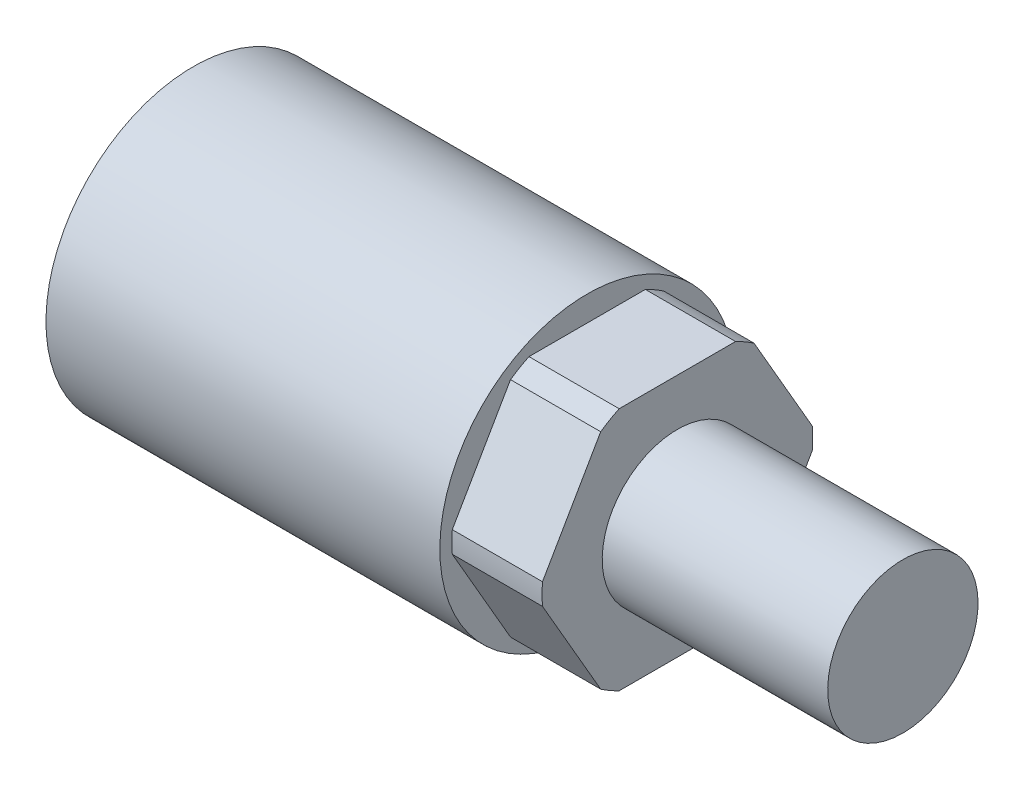
ISO-10303-21;
HEADER;
FILE_DESCRIPTION(('STEP AP214'),'2;1');
FILE_NAME('part.step','',(''),(''),'','','');
FILE_SCHEMA(('AUTOMOTIVE_DESIGN { 1 0 10303 214 1 1 1 1 }'));
ENDSEC;
DATA;
#1=APPLICATION_CONTEXT('core data for automotive mechanical design processes');
#2=APPLICATION_PROTOCOL_DEFINITION('international standard','automotive_design',2000,#1);
#3=PRODUCT_CONTEXT('',#1,'mechanical');
#4=PRODUCT('Part','Part','',(#3));
#5=PRODUCT_RELATED_PRODUCT_CATEGORY('part','',(#4));
#6=PRODUCT_DEFINITION_FORMATION('','',#4);
#7=PRODUCT_DEFINITION_CONTEXT('part definition',#1,'design');
#8=PRODUCT_DEFINITION('design','',#6,#7);
#9=PRODUCT_DEFINITION_SHAPE('','',#8);
#10=(LENGTH_UNIT() NAMED_UNIT(*) SI_UNIT(.MILLI.,.METRE.));
#11=(NAMED_UNIT(*) PLANE_ANGLE_UNIT() SI_UNIT($,.RADIAN.));
#12=(NAMED_UNIT(*) SI_UNIT($,.STERADIAN.) SOLID_ANGLE_UNIT());
#13=UNCERTAINTY_MEASURE_WITH_UNIT(LENGTH_MEASURE(1.E-05),#10,'distance_accuracy_value','');
#14=(GEOMETRIC_REPRESENTATION_CONTEXT(3) GLOBAL_UNCERTAINTY_ASSIGNED_CONTEXT((#13)) GLOBAL_UNIT_ASSIGNED_CONTEXT((#10,
#11,#12)) REPRESENTATION_CONTEXT('',''));
#15=CARTESIAN_POINT('',(0.,0.,0.));
#16=DIRECTION('',(0.,0.,1.));
#17=DIRECTION('',(1.,0.,0.));
#18=AXIS2_PLACEMENT_3D('',#15,#16,#17);
#19=CARTESIAN_POINT('',(0.,6.35,0.));
#20=DIRECTION('',(-1.,0.,0.));
#21=DIRECTION('',(0.,-1.,0.));
#22=AXIS2_PLACEMENT_3D('',#19,#20,#21);
#23=PLANE('',#22);
#24=CARTESIAN_POINT('',(0.,0.,0.));
#25=DIRECTION('',(-1.,0.,0.));
#26=DIRECTION('',(0.,-1.,0.));
#27=AXIS2_PLACEMENT_3D('',#24,#25,#26);
#28=CIRCLE('',#27,6.35);
#29=CARTESIAN_POINT('',(0.,-6.35,0.));
#30=VERTEX_POINT('',#29);
#31=EDGE_CURVE('E163',#30,#30,#28,.T.);
#32=ORIENTED_EDGE('',*,*,#31,.T.);
#33=EDGE_LOOP('',(#32));
#34=FACE_BOUND('',#33,.T.);
#35=DIRECTION('',(0.,0.866025403784438,0.5));
#36=VECTOR('',#35,1.);
#37=CARTESIAN_POINT('',(0.,0.,-11.9150661804009));
#38=LINE('',#37,#36);
#39=CARTESIAN_POINT('',(0.,0.901884679620536,-11.394362817844));
#40=VERTEX_POINT('',#39);
#41=CARTESIAN_POINT('',(0.,9.41686532037948,-6.47823645275736));
#42=VERTEX_POINT('',#41);
#43=EDGE_CURVE('E199',#40,#42,#38,.T.);
#44=ORIENTED_EDGE('',*,*,#43,.T.);
#45=CARTESIAN_POINT('',(0.,0.,0.));
#46=DIRECTION('',(-1.,0.,0.));
#47=DIRECTION('',(0.,-1.,0.));
#48=AXIS2_PLACEMENT_3D('',#45,#46,#47);
#49=CIRCLE('',#48,11.43);
#50=CARTESIAN_POINT('',(0.,10.31875,-4.91612636508663));
#51=VERTEX_POINT('',#50);
#52=EDGE_CURVE('E238',#51,#42,#49,.T.);
#53=ORIENTED_EDGE('',*,*,#52,.F.);
#54=DIRECTION('',(0.,0.,1.));
#55=VECTOR('',#54,1.);
#56=CARTESIAN_POINT('',(0.,10.31875,-5.95753309020045));
#57=LINE('',#56,#55);
#58=CARTESIAN_POINT('',(0.,10.31875,4.91612636508663));
#59=VERTEX_POINT('',#58);
#60=EDGE_CURVE('E133',#51,#59,#57,.T.);
#61=ORIENTED_EDGE('',*,*,#60,.T.);
#62=CARTESIAN_POINT('',(0.,9.41686532037948,6.47823645275736));
#63=VERTEX_POINT('',#62);
#64=EDGE_CURVE('E236',#63,#59,#49,.T.);
#65=ORIENTED_EDGE('',*,*,#64,.F.);
#66=DIRECTION('',(0.,-0.866025403784439,0.5));
#67=VECTOR('',#66,1.);
#68=CARTESIAN_POINT('',(0.,10.31875,5.95753309020045));
#69=LINE('',#68,#67);
#70=CARTESIAN_POINT('',(0.,0.901884679620534,11.394362817844));
#71=VERTEX_POINT('',#70);
#72=EDGE_CURVE('E205',#63,#71,#69,.T.);
#73=ORIENTED_EDGE('',*,*,#72,.T.);
#74=CARTESIAN_POINT('',(0.,-0.901884679620526,11.394362817844));
#75=VERTEX_POINT('',#74);
#76=EDGE_CURVE('E46',#75,#71,#49,.T.);
#77=ORIENTED_EDGE('',*,*,#76,.F.);
#78=DIRECTION('',(0.,-0.866025403784438,-0.5));
#79=VECTOR('',#78,1.);
#80=CARTESIAN_POINT('',(0.,0.,11.9150661804009));
#81=LINE('',#80,#79);
#82=CARTESIAN_POINT('',(0.,-9.41686532037948,6.47823645275736));
#83=VERTEX_POINT('',#82);
#84=EDGE_CURVE('E208',#75,#83,#81,.T.);
#85=ORIENTED_EDGE('',*,*,#84,.T.);
#86=CARTESIAN_POINT('',(0.,-10.31875,4.91612636508663));
#87=VERTEX_POINT('',#86);
#88=EDGE_CURVE('E12',#87,#83,#49,.T.);
#89=ORIENTED_EDGE('',*,*,#88,.F.);
#90=DIRECTION('',(0.,0.,-1.));
#91=VECTOR('',#90,1.);
#92=CARTESIAN_POINT('',(0.,-10.31875,5.95753309020045));
#93=LINE('',#92,#91);
#94=CARTESIAN_POINT('',(0.,-10.31875,-4.91612636508663));
#95=VERTEX_POINT('',#94);
#96=EDGE_CURVE('E211',#87,#95,#93,.T.);
#97=ORIENTED_EDGE('',*,*,#96,.T.);
#98=CARTESIAN_POINT('',(0.,-9.41686532037947,-6.47823645275737));
#99=VERTEX_POINT('',#98);
#100=EDGE_CURVE('E47',#99,#95,#49,.T.);
#101=ORIENTED_EDGE('',*,*,#100,.F.);
#102=DIRECTION('',(0.,0.866025403784439,-0.5));
#103=VECTOR('',#102,1.);
#104=CARTESIAN_POINT('',(0.,-10.31875,-5.95753309020046));
#105=LINE('',#104,#103);
#106=CARTESIAN_POINT('',(0.,-0.901884679620541,-11.394362817844));
#107=VERTEX_POINT('',#106);
#108=EDGE_CURVE('E202',#99,#107,#105,.T.);
#109=ORIENTED_EDGE('',*,*,#108,.T.);
#110=EDGE_CURVE('E142',#40,#107,#49,.T.);
#111=ORIENTED_EDGE('',*,*,#110,.F.);
#112=EDGE_LOOP('',(#44,#53,#61,#65,#73,#77,#85,#89,#97,#101,#109,#111));
#113=FACE_BOUND('',#112,.T.);
#114=ADVANCED_FACE('F39',(#34,#113),#23,.F.);
#115=CARTESIAN_POINT('',(-40.894,0.,0.));
#116=DIRECTION('',(-1.,0.,0.));
#117=DIRECTION('',(0.,-1.,0.));
#118=AXIS2_PLACEMENT_3D('',#115,#116,#117);
#119=CYLINDRICAL_SURFACE('',#118,11.43);
#120=DIRECTION('',(-1.,0.,0.));
#121=VECTOR('',#120,1.);
#122=CARTESIAN_POINT('',(-40.894,0.901884679620536,-11.394362817844));
#123=LINE('',#122,#121);
#124=CARTESIAN_POINT('',(-7.62,0.901884679620538,-11.394362817844));
#125=VERTEX_POINT('',#124);
#126=EDGE_CURVE('E166',#40,#125,#123,.T.);
#127=ORIENTED_EDGE('',*,*,#126,.F.);
#128=ORIENTED_EDGE('',*,*,#110,.T.);
#129=DIRECTION('',(-1.,0.,0.));
#130=VECTOR('',#129,1.);
#131=CARTESIAN_POINT('',(-40.894,-0.901884679620542,-11.394362817844));
#132=LINE('',#131,#130);
#133=CARTESIAN_POINT('',(-7.62,-0.901884679620541,-11.394362817844));
#134=VERTEX_POINT('',#133);
#135=EDGE_CURVE('E128',#134,#107,#132,.F.);
#136=ORIENTED_EDGE('',*,*,#135,.F.);
#137=CARTESIAN_POINT('',(-7.62,0.,0.));
#138=DIRECTION('',(-1.,0.,0.));
#139=DIRECTION('',(0.,-1.,0.));
#140=AXIS2_PLACEMENT_3D('',#137,#138,#139);
#141=CIRCLE('',#140,11.43);
#142=EDGE_CURVE('E140',#125,#134,#141,.T.);
#143=ORIENTED_EDGE('',*,*,#142,.F.);
#144=EDGE_LOOP('',(#127,#128,#136,#143));
#145=FACE_BOUND('',#144,.T.);
#146=ADVANCED_FACE('F139',(#145),#119,.T.);
#147=DIRECTION('',(-1.,0.,0.));
#148=VECTOR('',#147,1.);
#149=CARTESIAN_POINT('',(-40.894,9.41686532037948,-6.47823645275736));
#150=LINE('',#149,#148);
#151=CARTESIAN_POINT('',(-7.62,9.41686532037948,-6.47823645275736));
#152=VERTEX_POINT('',#151);
#153=EDGE_CURVE('E168',#152,#42,#150,.F.);
#154=ORIENTED_EDGE('',*,*,#153,.F.);
#155=CARTESIAN_POINT('',(-7.62,10.31875,-4.91612636508663));
#156=VERTEX_POINT('',#155);
#157=EDGE_CURVE('E147',#156,#152,#141,.T.);
#158=ORIENTED_EDGE('',*,*,#157,.F.);
#159=DIRECTION('',(-1.,0.,0.));
#160=VECTOR('',#159,1.);
#161=CARTESIAN_POINT('',(-40.894,10.31875,-4.91612636508663));
#162=LINE('',#161,#160);
#163=EDGE_CURVE('E185',#51,#156,#162,.T.);
#164=ORIENTED_EDGE('',*,*,#163,.F.);
#165=ORIENTED_EDGE('',*,*,#52,.T.);
#166=EDGE_LOOP('',(#154,#158,#164,#165));
#167=FACE_BOUND('',#166,.T.);
#168=ADVANCED_FACE('F247',(#167),#119,.T.);
#169=DIRECTION('',(-1.,0.,0.));
#170=VECTOR('',#169,1.);
#171=CARTESIAN_POINT('',(-40.894,-9.41686532037947,-6.47823645275737));
#172=LINE('',#171,#170);
#173=CARTESIAN_POINT('',(-7.62,-9.41686532037947,-6.47823645275738));
#174=VERTEX_POINT('',#173);
#175=EDGE_CURVE('E131',#99,#174,#172,.T.);
#176=ORIENTED_EDGE('',*,*,#175,.F.);
#177=ORIENTED_EDGE('',*,*,#100,.T.);
#178=DIRECTION('',(-1.,0.,0.));
#179=VECTOR('',#178,1.);
#180=CARTESIAN_POINT('',(-40.894,-10.31875,-4.91612636508663));
#181=LINE('',#180,#179);
#182=CARTESIAN_POINT('',(-7.62,-10.31875,-4.91612636508663));
#183=VERTEX_POINT('',#182);
#184=EDGE_CURVE('E173',#183,#95,#181,.F.);
#185=ORIENTED_EDGE('',*,*,#184,.F.);
#186=EDGE_CURVE('E148',#174,#183,#141,.T.);
#187=ORIENTED_EDGE('',*,*,#186,.F.);
#188=EDGE_LOOP('',(#176,#177,#185,#187));
#189=FACE_BOUND('',#188,.T.);
#190=ADVANCED_FACE('F218',(#189),#119,.T.);
#191=DIRECTION('',(-1.,0.,0.));
#192=VECTOR('',#191,1.);
#193=CARTESIAN_POINT('',(-40.894,-10.31875,4.91612636508663));
#194=LINE('',#193,#192);
#195=CARTESIAN_POINT('',(-7.62,-10.31875,4.91612636508663));
#196=VERTEX_POINT('',#195);
#197=EDGE_CURVE('E143',#87,#196,#194,.T.);
#198=ORIENTED_EDGE('',*,*,#197,.F.);
#199=ORIENTED_EDGE('',*,*,#88,.T.);
#200=DIRECTION('',(-1.,0.,0.));
#201=VECTOR('',#200,1.);
#202=CARTESIAN_POINT('',(-40.894,-9.41686532037948,6.47823645275736));
#203=LINE('',#202,#201);
#204=CARTESIAN_POINT('',(-7.62,-9.41686532037948,6.47823645275736));
#205=VERTEX_POINT('',#204);
#206=EDGE_CURVE('E178',#205,#83,#203,.F.);
#207=ORIENTED_EDGE('',*,*,#206,.F.);
#208=EDGE_CURVE('E151',#196,#205,#141,.T.);
#209=ORIENTED_EDGE('',*,*,#208,.F.);
#210=EDGE_LOOP('',(#198,#199,#207,#209));
#211=FACE_BOUND('',#210,.T.);
#212=ADVANCED_FACE('F227',(#211),#119,.T.);
#213=DIRECTION('',(-1.,0.,0.));
#214=VECTOR('',#213,1.);
#215=CARTESIAN_POINT('',(-40.894,-0.901884679620529,11.394362817844));
#216=LINE('',#215,#214);
#217=CARTESIAN_POINT('',(-7.62,-0.901884679620534,11.394362817844));
#218=VERTEX_POINT('',#217);
#219=EDGE_CURVE('E175',#75,#218,#216,.T.);
#220=ORIENTED_EDGE('',*,*,#219,.F.);
#221=ORIENTED_EDGE('',*,*,#76,.T.);
#222=DIRECTION('',(-1.,0.,0.));
#223=VECTOR('',#222,1.);
#224=CARTESIAN_POINT('',(-40.894,0.901884679620534,11.394362817844));
#225=LINE('',#224,#223);
#226=CARTESIAN_POINT('',(-7.62,0.901884679620536,11.394362817844));
#227=VERTEX_POINT('',#226);
#228=EDGE_CURVE('E183',#227,#71,#225,.F.);
#229=ORIENTED_EDGE('',*,*,#228,.F.);
#230=EDGE_CURVE('E154',#218,#227,#141,.T.);
#231=ORIENTED_EDGE('',*,*,#230,.F.);
#232=EDGE_LOOP('',(#220,#221,#229,#231));
#233=FACE_BOUND('',#232,.T.);
#234=ADVANCED_FACE('F294',(#233),#119,.T.);
#235=DIRECTION('',(-1.,0.,0.));
#236=VECTOR('',#235,1.);
#237=CARTESIAN_POINT('',(-40.894,9.41686532037948,6.47823645275736));
#238=LINE('',#237,#236);
#239=CARTESIAN_POINT('',(-7.62,9.41686532037947,6.47823645275737));
#240=VERTEX_POINT('',#239);
#241=EDGE_CURVE('E180',#63,#240,#238,.T.);
#242=ORIENTED_EDGE('',*,*,#241,.F.);
#243=ORIENTED_EDGE('',*,*,#64,.T.);
#244=DIRECTION('',(-1.,0.,0.));
#245=VECTOR('',#244,1.);
#246=CARTESIAN_POINT('',(-40.894,10.31875,4.91612636508663));
#247=LINE('',#246,#245);
#248=CARTESIAN_POINT('',(-7.62,10.31875,4.91612636508663));
#249=VERTEX_POINT('',#248);
#250=EDGE_CURVE('E188',#249,#59,#247,.F.);
#251=ORIENTED_EDGE('',*,*,#250,.F.);
#252=EDGE_CURVE('E149',#240,#249,#141,.T.);
#253=ORIENTED_EDGE('',*,*,#252,.F.);
#254=EDGE_LOOP('',(#242,#243,#251,#253));
#255=FACE_BOUND('',#254,.T.);
#256=ADVANCED_FACE('F268',(#255),#119,.T.);
#257=CARTESIAN_POINT('',(-7.62,11.43,0.));
#258=DIRECTION('',(-1.,0.,0.));
#259=DIRECTION('',(0.,-1.,0.));
#260=AXIS2_PLACEMENT_3D('',#257,#258,#259);
#261=PLANE('',#260);
#262=ORIENTED_EDGE('',*,*,#157,.T.);
#263=DIRECTION('',(0.,0.866025403784439,0.5));
#264=VECTOR('',#263,1.);
#265=CARTESIAN_POINT('',(-7.62,0.,-11.9150661804009));
#266=LINE('',#265,#264);
#267=EDGE_CURVE('E60',#125,#152,#266,.T.);
#268=ORIENTED_EDGE('',*,*,#267,.F.);
#269=ORIENTED_EDGE('',*,*,#142,.T.);
#270=DIRECTION('',(0.,0.866025403784439,-0.5));
#271=VECTOR('',#270,1.);
#272=CARTESIAN_POINT('',(-7.62,-10.31875,-5.95753309020046));
#273=LINE('',#272,#271);
#274=EDGE_CURVE('E54',#174,#134,#273,.T.);
#275=ORIENTED_EDGE('',*,*,#274,.F.);
#276=ORIENTED_EDGE('',*,*,#186,.T.);
#277=DIRECTION('',(0.,0.,-1.));
#278=VECTOR('',#277,1.);
#279=CARTESIAN_POINT('',(-7.62,-10.31875,5.95753309020045));
#280=LINE('',#279,#278);
#281=EDGE_CURVE('E190',#196,#183,#280,.T.);
#282=ORIENTED_EDGE('',*,*,#281,.F.);
#283=ORIENTED_EDGE('',*,*,#208,.T.);
#284=DIRECTION('',(0.,-0.866025403784439,-0.5));
#285=VECTOR('',#284,1.);
#286=CARTESIAN_POINT('',(-7.62,0.,11.9150661804009));
#287=LINE('',#286,#285);
#288=EDGE_CURVE('E195',#218,#205,#287,.T.);
#289=ORIENTED_EDGE('',*,*,#288,.F.);
#290=ORIENTED_EDGE('',*,*,#230,.T.);
#291=DIRECTION('',(0.,-0.866025403784439,0.5));
#292=VECTOR('',#291,1.);
#293=CARTESIAN_POINT('',(-7.62,10.31875,5.95753309020045));
#294=LINE('',#293,#292);
#295=EDGE_CURVE('E193',#240,#227,#294,.T.);
#296=ORIENTED_EDGE('',*,*,#295,.F.);
#297=ORIENTED_EDGE('',*,*,#252,.T.);
#298=DIRECTION('',(0.,0.,1.));
#299=VECTOR('',#298,1.);
#300=CARTESIAN_POINT('',(-7.62,10.31875,-5.95753309020045));
#301=LINE('',#300,#299);
#302=EDGE_CURVE('E191',#156,#249,#301,.T.);
#303=ORIENTED_EDGE('',*,*,#302,.F.);
#304=EDGE_LOOP('',(#262,#268,#269,#275,#276,#282,#283,#289,#290,#296,#297,#303));
#305=FACE_BOUND('',#304,.T.);
#306=CARTESIAN_POINT('',(-7.62,0.,0.));
#307=DIRECTION('',(-1.,0.,0.));
#308=DIRECTION('',(0.,-1.,0.));
#309=AXIS2_PLACEMENT_3D('',#306,#307,#308);
#310=CIRCLE('',#309,12.446);
#311=CARTESIAN_POINT('',(-7.62,-12.446,0.));
#312=VERTEX_POINT('',#311);
#313=EDGE_CURVE('E150',#312,#312,#310,.T.);
#314=ORIENTED_EDGE('',*,*,#313,.F.);
#315=EDGE_LOOP('',(#314));
#316=FACE_BOUND('',#315,.T.);
#317=ADVANCED_FACE('F145',(#305,#316),#261,.F.);
#318=CARTESIAN_POINT('',(-40.894,0.,0.));
#319=DIRECTION('',(-1.,0.,0.));
#320=DIRECTION('',(0.,-1.,0.));
#321=AXIS2_PLACEMENT_3D('',#318,#319,#320);
#322=CYLINDRICAL_SURFACE('',#321,12.446);
#323=CARTESIAN_POINT('',(-40.894,0.,0.));
#324=DIRECTION('',(-1.,0.,0.));
#325=DIRECTION('',(0.,-1.,0.));
#326=AXIS2_PLACEMENT_3D('',#323,#324,#325);
#327=CIRCLE('',#326,12.446);
#328=CARTESIAN_POINT('',(-40.894,-12.446,0.));
#329=VERTEX_POINT('',#328);
#330=EDGE_CURVE('E157',#329,#329,#327,.T.);
#331=ORIENTED_EDGE('',*,*,#330,.F.);
#332=EDGE_LOOP('',(#331));
#333=FACE_BOUND('',#332,.T.);
#334=ORIENTED_EDGE('',*,*,#313,.T.);
#335=EDGE_LOOP('',(#334));
#336=FACE_BOUND('',#335,.T.);
#337=ADVANCED_FACE('F283',(#333,#336),#322,.T.);
#338=CARTESIAN_POINT('',(-40.894,12.446,0.));
#339=DIRECTION('',(1.,0.,0.));
#340=DIRECTION('',(0.,1.,0.));
#341=AXIS2_PLACEMENT_3D('',#338,#339,#340);
#342=PLANE('',#341);
#343=ORIENTED_EDGE('',*,*,#330,.T.);
#344=EDGE_LOOP('',(#343));
#345=FACE_BOUND('',#344,.T.);
#346=ADVANCED_FACE('F278',(#345),#342,.F.);
#347=CARTESIAN_POINT('',(19.05,0.,0.));
#348=DIRECTION('',(-1.,0.,0.));
#349=DIRECTION('',(0.,-1.,0.));
#350=AXIS2_PLACEMENT_3D('',#347,#348,#349);
#351=PLANE('',#350);
#352=CARTESIAN_POINT('',(19.05,0.,0.));
#353=DIRECTION('',(-1.,0.,0.));
#354=DIRECTION('',(0.,-1.,0.));
#355=AXIS2_PLACEMENT_3D('',#352,#353,#354);
#356=CIRCLE('',#355,6.35);
#357=CARTESIAN_POINT('',(19.05,-6.35,0.));
#358=VERTEX_POINT('',#357);
#359=EDGE_CURVE('E160',#358,#358,#356,.T.);
#360=ORIENTED_EDGE('',*,*,#359,.F.);
#361=EDGE_LOOP('',(#360));
#362=FACE_BOUND('',#361,.T.);
#363=ADVANCED_FACE('F274',(#362),#351,.F.);
#364=CARTESIAN_POINT('',(-40.894,0.,0.));
#365=DIRECTION('',(-1.,0.,0.));
#366=DIRECTION('',(0.,-1.,0.));
#367=AXIS2_PLACEMENT_3D('',#364,#365,#366);
#368=CYLINDRICAL_SURFACE('',#367,6.35);
#369=ORIENTED_EDGE('',*,*,#31,.F.);
#370=EDGE_LOOP('',(#369));
#371=FACE_BOUND('',#370,.T.);
#372=ORIENTED_EDGE('',*,*,#359,.T.);
#373=EDGE_LOOP('',(#372));
#374=FACE_BOUND('',#373,.T.);
#375=ADVANCED_FACE('F271',(#371,#374),#368,.T.);
#376=CARTESIAN_POINT('',(-45.213771840578,-10.31875,5.95753309020045));
#377=DIRECTION('',(0.,-1.,0.));
#378=DIRECTION('',(1.,0.,0.));
#379=AXIS2_PLACEMENT_3D('',#376,#377,#378);
#380=PLANE('',#379);
#381=ORIENTED_EDGE('',*,*,#197,.T.);
#382=ORIENTED_EDGE('',*,*,#281,.T.);
#383=ORIENTED_EDGE('',*,*,#184,.T.);
#384=ORIENTED_EDGE('',*,*,#96,.F.);
#385=EDGE_LOOP('',(#381,#382,#383,#384));
#386=FACE_BOUND('',#385,.T.);
#387=ADVANCED_FACE('F223',(#386),#380,.T.);
#388=CARTESIAN_POINT('',(-45.213771840578,-10.31875,-5.95753309020046));
#389=DIRECTION('',(0.,-0.5,-0.866025403784438));
#390=DIRECTION('',(0.,0.866025403784439,-0.5));
#391=AXIS2_PLACEMENT_3D('',#388,#389,#390);
#392=PLANE('',#391);
#393=ORIENTED_EDGE('',*,*,#175,.T.);
#394=ORIENTED_EDGE('',*,*,#274,.T.);
#395=ORIENTED_EDGE('',*,*,#135,.T.);
#396=ORIENTED_EDGE('',*,*,#108,.F.);
#397=EDGE_LOOP('',(#393,#394,#395,#396));
#398=FACE_BOUND('',#397,.T.);
#399=ADVANCED_FACE('F127',(#398),#392,.T.);
#400=CARTESIAN_POINT('',(-45.213771840578,0.,-11.9150661804009));
#401=DIRECTION('',(0.,0.5,-0.866025403784438));
#402=DIRECTION('',(0.,0.866025403784439,0.5));
#403=AXIS2_PLACEMENT_3D('',#400,#401,#402);
#404=PLANE('',#403);
#405=ORIENTED_EDGE('',*,*,#126,.T.);
#406=ORIENTED_EDGE('',*,*,#267,.T.);
#407=ORIENTED_EDGE('',*,*,#153,.T.);
#408=ORIENTED_EDGE('',*,*,#43,.F.);
#409=EDGE_LOOP('',(#405,#406,#407,#408));
#410=FACE_BOUND('',#409,.T.);
#411=ADVANCED_FACE('F250',(#410),#404,.T.);
#412=CARTESIAN_POINT('',(-45.213771840578,10.31875,-5.95753309020045));
#413=DIRECTION('',(0.,1.,0.));
#414=DIRECTION('',(-1.,0.,0.));
#415=AXIS2_PLACEMENT_3D('',#412,#413,#414);
#416=PLANE('',#415);
#417=ORIENTED_EDGE('',*,*,#163,.T.);
#418=ORIENTED_EDGE('',*,*,#302,.T.);
#419=ORIENTED_EDGE('',*,*,#250,.T.);
#420=ORIENTED_EDGE('',*,*,#60,.F.);
#421=EDGE_LOOP('',(#417,#418,#419,#420));
#422=FACE_BOUND('',#421,.T.);
#423=ADVANCED_FACE('F252',(#422),#416,.T.);
#424=CARTESIAN_POINT('',(-45.213771840578,10.31875,5.95753309020045));
#425=DIRECTION('',(0.,0.5,0.866025403784438));
#426=DIRECTION('',(0.,-0.866025403784439,0.5));
#427=AXIS2_PLACEMENT_3D('',#424,#425,#426);
#428=PLANE('',#427);
#429=ORIENTED_EDGE('',*,*,#241,.T.);
#430=ORIENTED_EDGE('',*,*,#295,.T.);
#431=ORIENTED_EDGE('',*,*,#228,.T.);
#432=ORIENTED_EDGE('',*,*,#72,.F.);
#433=EDGE_LOOP('',(#429,#430,#431,#432));
#434=FACE_BOUND('',#433,.T.);
#435=ADVANCED_FACE('F258',(#434),#428,.T.);
#436=CARTESIAN_POINT('',(-45.213771840578,0.,11.9150661804009));
#437=DIRECTION('',(0.,-0.5,0.866025403784438));
#438=DIRECTION('',(0.,-0.866025403784439,-0.5));
#439=AXIS2_PLACEMENT_3D('',#436,#437,#438);
#440=PLANE('',#439);
#441=ORIENTED_EDGE('',*,*,#219,.T.);
#442=ORIENTED_EDGE('',*,*,#288,.T.);
#443=ORIENTED_EDGE('',*,*,#206,.T.);
#444=ORIENTED_EDGE('',*,*,#84,.F.);
#445=EDGE_LOOP('',(#441,#442,#443,#444));
#446=FACE_BOUND('',#445,.T.);
#447=ADVANCED_FACE('F229',(#446),#440,.T.);
#448=CLOSED_SHELL('',(#114,#146,#168,#190,#212,#234,#256,#317,#337,#346,#363,#375,#387,#399,
#411,#423,#435,#447));
#449=MANIFOLD_SOLID_BREP('B2',#448);
#450=ADVANCED_BREP_SHAPE_REPRESENTATION('',(#18,#449),#14);
#451=SHAPE_DEFINITION_REPRESENTATION(#9,#450);
ENDSEC;
END-ISO-10303-21;
